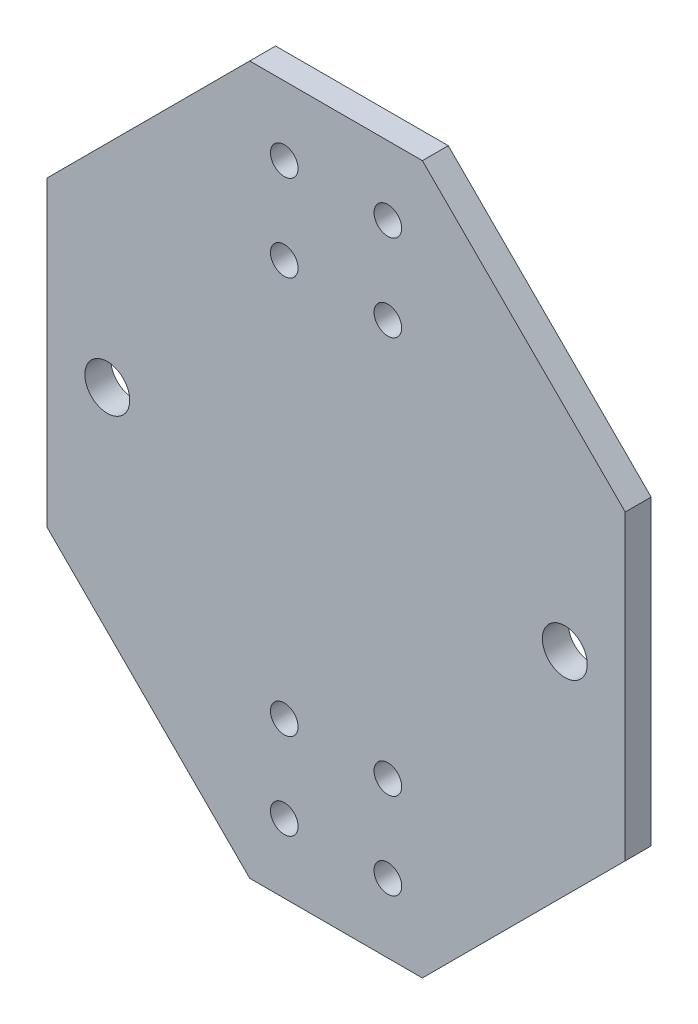
ISO-10303-21;
HEADER;
FILE_DESCRIPTION(('STEP AP214'),'2;1');
FILE_NAME('part.step','',(''),(''),'','','');
FILE_SCHEMA(('AUTOMOTIVE_DESIGN { 1 0 10303 214 1 1 1 1 }'));
ENDSEC;
DATA;
#1=APPLICATION_CONTEXT('core data for automotive mechanical design processes');
#2=APPLICATION_PROTOCOL_DEFINITION('international standard','automotive_design',2000,#1);
#3=PRODUCT_CONTEXT('',#1,'mechanical');
#4=PRODUCT('Part','Part','',(#3));
#5=PRODUCT_RELATED_PRODUCT_CATEGORY('part','',(#4));
#6=PRODUCT_DEFINITION_FORMATION('','',#4);
#7=PRODUCT_DEFINITION_CONTEXT('part definition',#1,'design');
#8=PRODUCT_DEFINITION('design','',#6,#7);
#9=PRODUCT_DEFINITION_SHAPE('','',#8);
#10=(LENGTH_UNIT() NAMED_UNIT(*) SI_UNIT(.MILLI.,.METRE.));
#11=(NAMED_UNIT(*) PLANE_ANGLE_UNIT() SI_UNIT($,.RADIAN.));
#12=(NAMED_UNIT(*) SI_UNIT($,.STERADIAN.) SOLID_ANGLE_UNIT());
#13=UNCERTAINTY_MEASURE_WITH_UNIT(LENGTH_MEASURE(1.E-05),#10,'distance_accuracy_value','');
#14=(GEOMETRIC_REPRESENTATION_CONTEXT(3) GLOBAL_UNCERTAINTY_ASSIGNED_CONTEXT((#13)) GLOBAL_UNIT_ASSIGNED_CONTEXT((#10,
#11,#12)) REPRESENTATION_CONTEXT('',''));
#15=CARTESIAN_POINT('',(0.,0.,0.));
#16=DIRECTION('',(0.,0.,1.));
#17=DIRECTION('',(1.,0.,0.));
#18=AXIS2_PLACEMENT_3D('',#15,#16,#17);
#19=CARTESIAN_POINT('',(0.,0.,3.));
#20=DIRECTION('',(0.,0.,-1.));
#21=DIRECTION('',(-1.,0.,0.));
#22=AXIS2_PLACEMENT_3D('',#19,#20,#21);
#23=PLANE('',#22);
#24=DIRECTION('',(-0.707106781186547,-0.707106781186549,0.));
#25=VECTOR('',#24,1.);
#26=CARTESIAN_POINT('',(-93.5005686119825,-317.094950634666,3.));
#27=LINE('',#26,#25);
#28=CARTESIAN_POINT('',(-70.0005686119825,-293.594950634666,3.));
#29=VERTEX_POINT('',#28);
#30=CARTESIAN_POINT('',(-93.5005686119825,-317.094950634666,3.));
#31=VERTEX_POINT('',#30);
#32=EDGE_CURVE('E147',#29,#31,#27,.T.);
#33=ORIENTED_EDGE('',*,*,#32,.T.);
#34=DIRECTION('',(0.,-1.,0.));
#35=VECTOR('',#34,1.);
#36=CARTESIAN_POINT('',(-93.5005686119825,-352.094950634666,3.));
#37=LINE('',#36,#35);
#38=CARTESIAN_POINT('',(-93.5005686119825,-352.094950634666,3.));
#39=VERTEX_POINT('',#38);
#40=EDGE_CURVE('E95',#31,#39,#37,.T.);
#41=ORIENTED_EDGE('',*,*,#40,.T.);
#42=DIRECTION('',(0.707106781186544,-0.707106781186551,0.));
#43=VECTOR('',#42,1.);
#44=CARTESIAN_POINT('',(-70.0005686119825,-375.594950634666,3.));
#45=LINE('',#44,#43);
#46=CARTESIAN_POINT('',(-70.0005686119825,-375.594950634666,3.));
#47=VERTEX_POINT('',#46);
#48=EDGE_CURVE('E162',#39,#47,#45,.T.);
#49=ORIENTED_EDGE('',*,*,#48,.T.);
#50=DIRECTION('',(1.,0.,0.));
#51=VECTOR('',#50,1.);
#52=CARTESIAN_POINT('',(-50.0005686119826,-375.594950634666,3.));
#53=LINE('',#52,#51);
#54=CARTESIAN_POINT('',(-50.0005686119826,-375.594950634666,3.));
#55=VERTEX_POINT('',#54);
#56=EDGE_CURVE('E175',#47,#55,#53,.T.);
#57=ORIENTED_EDGE('',*,*,#56,.T.);
#58=DIRECTION('',(0.707106781186544,0.707106781186551,0.));
#59=VECTOR('',#58,1.);
#60=CARTESIAN_POINT('',(-26.5005686119826,-352.094950634666,3.));
#61=LINE('',#60,#59);
#62=CARTESIAN_POINT('',(-26.5005686119826,-352.094950634666,3.));
#63=VERTEX_POINT('',#62);
#64=EDGE_CURVE('E114',#55,#63,#61,.T.);
#65=ORIENTED_EDGE('',*,*,#64,.T.);
#66=DIRECTION('',(0.,1.,0.));
#67=VECTOR('',#66,1.);
#68=CARTESIAN_POINT('',(-26.5005686119826,-317.094950634666,3.));
#69=LINE('',#68,#67);
#70=CARTESIAN_POINT('',(-26.5005686119826,-317.094950634666,3.));
#71=VERTEX_POINT('',#70);
#72=EDGE_CURVE('E108',#63,#71,#69,.T.);
#73=ORIENTED_EDGE('',*,*,#72,.T.);
#74=DIRECTION('',(-0.707106781186544,0.707106781186551,0.));
#75=VECTOR('',#74,1.);
#76=CARTESIAN_POINT('',(-50.0005686119826,-293.594950634666,3.));
#77=LINE('',#76,#75);
#78=CARTESIAN_POINT('',(-50.0005686119826,-293.594950634666,3.));
#79=VERTEX_POINT('',#78);
#80=EDGE_CURVE('E112',#71,#79,#77,.T.);
#81=ORIENTED_EDGE('',*,*,#80,.T.);
#82=DIRECTION('',(-1.,0.,0.));
#83=VECTOR('',#82,1.);
#84=CARTESIAN_POINT('',(-70.0005686119825,-293.594950634666,3.));
#85=LINE('',#84,#83);
#86=EDGE_CURVE('E52',#79,#29,#85,.T.);
#87=ORIENTED_EDGE('',*,*,#86,.T.);
#88=EDGE_LOOP('',(#33,#41,#49,#57,#65,#73,#81,#87));
#89=FACE_BOUND('',#88,.T.);
#90=CARTESIAN_POINT('',(-86.5005686119826,-334.594950634666,3.));
#91=DIRECTION('',(0.,0.,1.));
#92=DIRECTION('',(1.,0.,0.));
#93=AXIS2_PLACEMENT_3D('',#90,#91,#92);
#94=CIRCLE('',#93,2.6);
#95=CARTESIAN_POINT('',(-83.9005686119826,-334.594950634666,3.));
#96=VERTEX_POINT('',#95);
#97=EDGE_CURVE('E136',#96,#96,#94,.T.);
#98=ORIENTED_EDGE('',*,*,#97,.F.);
#99=EDGE_LOOP('',(#98));
#100=FACE_BOUND('',#99,.T.);
#101=CARTESIAN_POINT('',(-33.5005686119826,-334.594950634666,3.));
#102=DIRECTION('',(0.,0.,1.));
#103=DIRECTION('',(1.,0.,0.));
#104=AXIS2_PLACEMENT_3D('',#101,#102,#103);
#105=CIRCLE('',#104,2.6);
#106=CARTESIAN_POINT('',(-30.9005686119826,-334.594950634666,3.));
#107=VERTEX_POINT('',#106);
#108=EDGE_CURVE('E184',#107,#107,#105,.T.);
#109=ORIENTED_EDGE('',*,*,#108,.F.);
#110=EDGE_LOOP('',(#109));
#111=FACE_BOUND('',#110,.T.);
#112=CARTESIAN_POINT('',(-66.0005686119825,-301.594950634666,3.));
#113=DIRECTION('',(0.,0.,1.));
#114=DIRECTION('',(1.,0.,0.));
#115=AXIS2_PLACEMENT_3D('',#112,#113,#114);
#116=CIRCLE('',#115,1.6);
#117=CARTESIAN_POINT('',(-64.4005686119825,-301.594950634666,3.));
#118=VERTEX_POINT('',#117);
#119=EDGE_CURVE('E190',#118,#118,#116,.T.);
#120=ORIENTED_EDGE('',*,*,#119,.F.);
#121=EDGE_LOOP('',(#120));
#122=FACE_BOUND('',#121,.T.);
#123=CARTESIAN_POINT('',(-54.0005686119826,-301.594950634666,3.));
#124=DIRECTION('',(0.,0.,1.));
#125=DIRECTION('',(1.,0.,0.));
#126=AXIS2_PLACEMENT_3D('',#123,#124,#125);
#127=CIRCLE('',#126,1.6);
#128=CARTESIAN_POINT('',(-52.4005686119826,-301.594950634666,3.));
#129=VERTEX_POINT('',#128);
#130=EDGE_CURVE('E196',#129,#129,#127,.T.);
#131=ORIENTED_EDGE('',*,*,#130,.F.);
#132=EDGE_LOOP('',(#131));
#133=FACE_BOUND('',#132,.T.);
#134=CARTESIAN_POINT('',(-66.0005686119825,-367.594950634666,3.));
#135=DIRECTION('',(0.,0.,1.));
#136=DIRECTION('',(1.,0.,0.));
#137=AXIS2_PLACEMENT_3D('',#134,#135,#136);
#138=CIRCLE('',#137,1.6);
#139=CARTESIAN_POINT('',(-64.4005686119825,-367.594950634666,3.));
#140=VERTEX_POINT('',#139);
#141=EDGE_CURVE('E202',#140,#140,#138,.T.);
#142=ORIENTED_EDGE('',*,*,#141,.F.);
#143=EDGE_LOOP('',(#142));
#144=FACE_BOUND('',#143,.T.);
#145=CARTESIAN_POINT('',(-54.0005686119826,-367.594950634666,3.));
#146=DIRECTION('',(0.,0.,1.));
#147=DIRECTION('',(1.,0.,0.));
#148=AXIS2_PLACEMENT_3D('',#145,#146,#147);
#149=CIRCLE('',#148,1.6);
#150=CARTESIAN_POINT('',(-52.4005686119826,-367.594950634666,3.));
#151=VERTEX_POINT('',#150);
#152=EDGE_CURVE('E208',#151,#151,#149,.T.);
#153=ORIENTED_EDGE('',*,*,#152,.F.);
#154=EDGE_LOOP('',(#153));
#155=FACE_BOUND('',#154,.T.);
#156=CARTESIAN_POINT('',(-66.0005686119825,-311.594950634666,3.));
#157=DIRECTION('',(0.,0.,1.));
#158=DIRECTION('',(1.,0.,0.));
#159=AXIS2_PLACEMENT_3D('',#156,#157,#158);
#160=CIRCLE('',#159,1.6);
#161=CARTESIAN_POINT('',(-64.4005686119825,-311.594950634666,3.));
#162=VERTEX_POINT('',#161);
#163=EDGE_CURVE('E214',#162,#162,#160,.T.);
#164=ORIENTED_EDGE('',*,*,#163,.F.);
#165=EDGE_LOOP('',(#164));
#166=FACE_BOUND('',#165,.T.);
#167=CARTESIAN_POINT('',(-54.0005686119826,-311.594950634666,3.));
#168=DIRECTION('',(0.,0.,1.));
#169=DIRECTION('',(1.,0.,0.));
#170=AXIS2_PLACEMENT_3D('',#167,#168,#169);
#171=CIRCLE('',#170,1.6);
#172=CARTESIAN_POINT('',(-52.4005686119826,-311.594950634666,3.));
#173=VERTEX_POINT('',#172);
#174=EDGE_CURVE('E220',#173,#173,#171,.T.);
#175=ORIENTED_EDGE('',*,*,#174,.F.);
#176=EDGE_LOOP('',(#175));
#177=FACE_BOUND('',#176,.T.);
#178=CARTESIAN_POINT('',(-66.0005686119825,-357.594950634666,3.));
#179=DIRECTION('',(0.,0.,1.));
#180=DIRECTION('',(1.,0.,0.));
#181=AXIS2_PLACEMENT_3D('',#178,#179,#180);
#182=CIRCLE('',#181,1.6);
#183=CARTESIAN_POINT('',(-64.4005686119825,-357.594950634666,3.));
#184=VERTEX_POINT('',#183);
#185=EDGE_CURVE('E226',#184,#184,#182,.T.);
#186=ORIENTED_EDGE('',*,*,#185,.F.);
#187=EDGE_LOOP('',(#186));
#188=FACE_BOUND('',#187,.T.);
#189=CARTESIAN_POINT('',(-54.0005686119826,-357.594950634666,3.));
#190=DIRECTION('',(0.,0.,1.));
#191=DIRECTION('',(1.,0.,0.));
#192=AXIS2_PLACEMENT_3D('',#189,#190,#191);
#193=CIRCLE('',#192,1.6);
#194=CARTESIAN_POINT('',(-52.4005686119826,-357.594950634666,3.));
#195=VERTEX_POINT('',#194);
#196=EDGE_CURVE('E232',#195,#195,#193,.T.);
#197=ORIENTED_EDGE('',*,*,#196,.F.);
#198=EDGE_LOOP('',(#197));
#199=FACE_BOUND('',#198,.T.);
#200=ADVANCED_FACE('F35',(#89,#100,#111,#122,#133,#144,#155,#166,#177,#188,#199),#23,.F.);
#201=CARTESIAN_POINT('',(0.,0.,0.));
#202=DIRECTION('',(0.,0.,-1.));
#203=DIRECTION('',(-1.,0.,0.));
#204=AXIS2_PLACEMENT_3D('',#201,#202,#203);
#205=PLANE('',#204);
#206=CARTESIAN_POINT('',(-66.0005686119825,-357.594950634666,0.));
#207=DIRECTION('',(0.,0.,1.));
#208=DIRECTION('',(1.,0.,0.));
#209=AXIS2_PLACEMENT_3D('',#206,#207,#208);
#210=CIRCLE('',#209,1.6);
#211=CARTESIAN_POINT('',(-64.4005686119825,-357.594950634666,0.));
#212=VERTEX_POINT('',#211);
#213=EDGE_CURVE('E229',#212,#212,#210,.T.);
#214=ORIENTED_EDGE('',*,*,#213,.T.);
#215=EDGE_LOOP('',(#214));
#216=FACE_BOUND('',#215,.T.);
#217=CARTESIAN_POINT('',(-66.0005686119825,-311.594950634666,0.));
#218=DIRECTION('',(0.,0.,1.));
#219=DIRECTION('',(1.,0.,0.));
#220=AXIS2_PLACEMENT_3D('',#217,#218,#219);
#221=CIRCLE('',#220,1.6);
#222=CARTESIAN_POINT('',(-64.4005686119825,-311.594950634666,0.));
#223=VERTEX_POINT('',#222);
#224=EDGE_CURVE('E217',#223,#223,#221,.T.);
#225=ORIENTED_EDGE('',*,*,#224,.T.);
#226=EDGE_LOOP('',(#225));
#227=FACE_BOUND('',#226,.T.);
#228=CARTESIAN_POINT('',(-66.0005686119825,-367.594950634666,0.));
#229=DIRECTION('',(0.,0.,1.));
#230=DIRECTION('',(1.,0.,0.));
#231=AXIS2_PLACEMENT_3D('',#228,#229,#230);
#232=CIRCLE('',#231,1.6);
#233=CARTESIAN_POINT('',(-64.4005686119825,-367.594950634666,0.));
#234=VERTEX_POINT('',#233);
#235=EDGE_CURVE('E205',#234,#234,#232,.T.);
#236=ORIENTED_EDGE('',*,*,#235,.T.);
#237=EDGE_LOOP('',(#236));
#238=FACE_BOUND('',#237,.T.);
#239=CARTESIAN_POINT('',(-66.0005686119825,-301.594950634666,0.));
#240=DIRECTION('',(0.,0.,1.));
#241=DIRECTION('',(1.,0.,0.));
#242=AXIS2_PLACEMENT_3D('',#239,#240,#241);
#243=CIRCLE('',#242,1.6);
#244=CARTESIAN_POINT('',(-64.4005686119825,-301.594950634666,0.));
#245=VERTEX_POINT('',#244);
#246=EDGE_CURVE('E193',#245,#245,#243,.T.);
#247=ORIENTED_EDGE('',*,*,#246,.T.);
#248=EDGE_LOOP('',(#247));
#249=FACE_BOUND('',#248,.T.);
#250=CARTESIAN_POINT('',(-86.5005686119826,-334.594950634666,0.));
#251=DIRECTION('',(0.,0.,1.));
#252=DIRECTION('',(1.,0.,0.));
#253=AXIS2_PLACEMENT_3D('',#250,#251,#252);
#254=CIRCLE('',#253,2.6);
#255=CARTESIAN_POINT('',(-83.9005686119826,-334.594950634666,0.));
#256=VERTEX_POINT('',#255);
#257=EDGE_CURVE('E181',#256,#256,#254,.T.);
#258=ORIENTED_EDGE('',*,*,#257,.T.);
#259=EDGE_LOOP('',(#258));
#260=FACE_BOUND('',#259,.T.);
#261=DIRECTION('',(-0.707106781186547,-0.707106781186549,0.));
#262=VECTOR('',#261,1.);
#263=CARTESIAN_POINT('',(-93.5005686119825,-317.094950634666,0.));
#264=LINE('',#263,#262);
#265=CARTESIAN_POINT('',(-70.0005686119825,-293.594950634666,0.));
#266=VERTEX_POINT('',#265);
#267=CARTESIAN_POINT('',(-93.5005686119825,-317.094950634666,0.));
#268=VERTEX_POINT('',#267);
#269=EDGE_CURVE('E132',#266,#268,#264,.T.);
#270=ORIENTED_EDGE('',*,*,#269,.F.);
#271=DIRECTION('',(-1.,0.,0.));
#272=VECTOR('',#271,1.);
#273=CARTESIAN_POINT('',(-70.0005686119825,-293.594950634666,0.));
#274=LINE('',#273,#272);
#275=CARTESIAN_POINT('',(-50.0005686119826,-293.594950634666,0.));
#276=VERTEX_POINT('',#275);
#277=EDGE_CURVE('E87',#276,#266,#274,.T.);
#278=ORIENTED_EDGE('',*,*,#277,.F.);
#279=DIRECTION('',(-0.707106781186544,0.707106781186551,0.));
#280=VECTOR('',#279,1.);
#281=CARTESIAN_POINT('',(-50.0005686119826,-293.594950634666,0.));
#282=LINE('',#281,#280);
#283=CARTESIAN_POINT('',(-26.5005686119826,-317.094950634666,0.));
#284=VERTEX_POINT('',#283);
#285=EDGE_CURVE('E81',#284,#276,#282,.T.);
#286=ORIENTED_EDGE('',*,*,#285,.F.);
#287=DIRECTION('',(0.,1.,0.));
#288=VECTOR('',#287,1.);
#289=CARTESIAN_POINT('',(-26.5005686119826,-317.094950634666,0.));
#290=LINE('',#289,#288);
#291=CARTESIAN_POINT('',(-26.5005686119826,-352.094950634666,0.));
#292=VERTEX_POINT('',#291);
#293=EDGE_CURVE('E122',#292,#284,#290,.T.);
#294=ORIENTED_EDGE('',*,*,#293,.F.);
#295=DIRECTION('',(0.707106781186544,0.707106781186551,0.));
#296=VECTOR('',#295,1.);
#297=CARTESIAN_POINT('',(-26.5005686119826,-352.094950634666,0.));
#298=LINE('',#297,#296);
#299=CARTESIAN_POINT('',(-50.0005686119826,-375.594950634666,0.));
#300=VERTEX_POINT('',#299);
#301=EDGE_CURVE('E142',#300,#292,#298,.T.);
#302=ORIENTED_EDGE('',*,*,#301,.F.);
#303=DIRECTION('',(1.,0.,0.));
#304=VECTOR('',#303,1.);
#305=CARTESIAN_POINT('',(-50.0005686119826,-375.594950634666,0.));
#306=LINE('',#305,#304);
#307=CARTESIAN_POINT('',(-70.0005686119825,-375.594950634666,0.));
#308=VERTEX_POINT('',#307);
#309=EDGE_CURVE('E140',#308,#300,#306,.T.);
#310=ORIENTED_EDGE('',*,*,#309,.F.);
#311=DIRECTION('',(0.707106781186544,-0.707106781186551,0.));
#312=VECTOR('',#311,1.);
#313=CARTESIAN_POINT('',(-70.0005686119825,-375.594950634666,0.));
#314=LINE('',#313,#312);
#315=CARTESIAN_POINT('',(-93.5005686119825,-352.094950634666,0.));
#316=VERTEX_POINT('',#315);
#317=EDGE_CURVE('E138',#316,#308,#314,.T.);
#318=ORIENTED_EDGE('',*,*,#317,.F.);
#319=DIRECTION('',(0.,-1.,0.));
#320=VECTOR('',#319,1.);
#321=CARTESIAN_POINT('',(-93.5005686119825,-352.094950634666,0.));
#322=LINE('',#321,#320);
#323=EDGE_CURVE('E135',#268,#316,#322,.T.);
#324=ORIENTED_EDGE('',*,*,#323,.F.);
#325=EDGE_LOOP('',(#270,#278,#286,#294,#302,#310,#318,#324));
#326=FACE_BOUND('',#325,.T.);
#327=CARTESIAN_POINT('',(-33.5005686119826,-334.594950634666,0.));
#328=DIRECTION('',(0.,0.,1.));
#329=DIRECTION('',(1.,0.,0.));
#330=AXIS2_PLACEMENT_3D('',#327,#328,#329);
#331=CIRCLE('',#330,2.6);
#332=CARTESIAN_POINT('',(-30.9005686119826,-334.594950634666,0.));
#333=VERTEX_POINT('',#332);
#334=EDGE_CURVE('E187',#333,#333,#331,.T.);
#335=ORIENTED_EDGE('',*,*,#334,.T.);
#336=EDGE_LOOP('',(#335));
#337=FACE_BOUND('',#336,.T.);
#338=CARTESIAN_POINT('',(-54.0005686119826,-301.594950634666,0.));
#339=DIRECTION('',(0.,0.,1.));
#340=DIRECTION('',(1.,0.,0.));
#341=AXIS2_PLACEMENT_3D('',#338,#339,#340);
#342=CIRCLE('',#341,1.6);
#343=CARTESIAN_POINT('',(-52.4005686119826,-301.594950634666,0.));
#344=VERTEX_POINT('',#343);
#345=EDGE_CURVE('E199',#344,#344,#342,.T.);
#346=ORIENTED_EDGE('',*,*,#345,.T.);
#347=EDGE_LOOP('',(#346));
#348=FACE_BOUND('',#347,.T.);
#349=CARTESIAN_POINT('',(-54.0005686119826,-367.594950634666,0.));
#350=DIRECTION('',(0.,0.,1.));
#351=DIRECTION('',(1.,0.,0.));
#352=AXIS2_PLACEMENT_3D('',#349,#350,#351);
#353=CIRCLE('',#352,1.6);
#354=CARTESIAN_POINT('',(-52.4005686119826,-367.594950634666,0.));
#355=VERTEX_POINT('',#354);
#356=EDGE_CURVE('E211',#355,#355,#353,.T.);
#357=ORIENTED_EDGE('',*,*,#356,.T.);
#358=EDGE_LOOP('',(#357));
#359=FACE_BOUND('',#358,.T.);
#360=CARTESIAN_POINT('',(-54.0005686119826,-311.594950634666,0.));
#361=DIRECTION('',(0.,0.,1.));
#362=DIRECTION('',(1.,0.,0.));
#363=AXIS2_PLACEMENT_3D('',#360,#361,#362);
#364=CIRCLE('',#363,1.6);
#365=CARTESIAN_POINT('',(-52.4005686119826,-311.594950634666,0.));
#366=VERTEX_POINT('',#365);
#367=EDGE_CURVE('E223',#366,#366,#364,.T.);
#368=ORIENTED_EDGE('',*,*,#367,.T.);
#369=EDGE_LOOP('',(#368));
#370=FACE_BOUND('',#369,.T.);
#371=CARTESIAN_POINT('',(-54.0005686119826,-357.594950634666,0.));
#372=DIRECTION('',(0.,0.,1.));
#373=DIRECTION('',(1.,0.,0.));
#374=AXIS2_PLACEMENT_3D('',#371,#372,#373);
#375=CIRCLE('',#374,1.6);
#376=CARTESIAN_POINT('',(-52.4005686119826,-357.594950634666,0.));
#377=VERTEX_POINT('',#376);
#378=EDGE_CURVE('E235',#377,#377,#375,.T.);
#379=ORIENTED_EDGE('',*,*,#378,.T.);
#380=EDGE_LOOP('',(#379));
#381=FACE_BOUND('',#380,.T.);
#382=ADVANCED_FACE('F166',(#216,#227,#238,#249,#260,#326,#337,#348,#359,#370,#381),#205,.T.);
#383=CARTESIAN_POINT('',(-93.5005686119825,-317.094950634666,3.));
#384=DIRECTION('',(0.707106781186548,-0.707106781186546,0.));
#385=DIRECTION('',(0.707106781186547,0.707106781186549,0.));
#386=AXIS2_PLACEMENT_3D('',#383,#384,#385);
#387=PLANE('',#386);
#388=ORIENTED_EDGE('',*,*,#269,.T.);
#389=DIRECTION('',(0.,0.,-1.));
#390=VECTOR('',#389,1.);
#391=CARTESIAN_POINT('',(-93.5005686119825,-317.094950634666,3.));
#392=LINE('',#391,#390);
#393=EDGE_CURVE('E11',#31,#268,#392,.T.);
#394=ORIENTED_EDGE('',*,*,#393,.F.);
#395=ORIENTED_EDGE('',*,*,#32,.F.);
#396=DIRECTION('',(0.,0.,-1.));
#397=VECTOR('',#396,1.);
#398=CARTESIAN_POINT('',(-70.0005686119825,-293.594950634666,3.));
#399=LINE('',#398,#397);
#400=EDGE_CURVE('E128',#29,#266,#399,.T.);
#401=ORIENTED_EDGE('',*,*,#400,.T.);
#402=EDGE_LOOP('',(#388,#394,#395,#401));
#403=FACE_BOUND('',#402,.T.);
#404=ADVANCED_FACE('F37',(#403),#387,.F.);
#405=CARTESIAN_POINT('',(-93.5005686119825,-352.094950634666,3.));
#406=DIRECTION('',(1.,0.,0.));
#407=DIRECTION('',(0.,0.,-1.));
#408=AXIS2_PLACEMENT_3D('',#405,#406,#407);
#409=PLANE('',#408);
#410=ORIENTED_EDGE('',*,*,#323,.T.);
#411=DIRECTION('',(0.,0.,-1.));
#412=VECTOR('',#411,1.);
#413=CARTESIAN_POINT('',(-93.5005686119825,-352.094950634666,3.));
#414=LINE('',#413,#412);
#415=EDGE_CURVE('E44',#39,#316,#414,.T.);
#416=ORIENTED_EDGE('',*,*,#415,.F.);
#417=ORIENTED_EDGE('',*,*,#40,.F.);
#418=ORIENTED_EDGE('',*,*,#393,.T.);
#419=EDGE_LOOP('',(#410,#416,#417,#418));
#420=FACE_BOUND('',#419,.T.);
#421=ADVANCED_FACE('F267',(#420),#409,.F.);
#422=CARTESIAN_POINT('',(-70.0005686119825,-375.594950634666,3.));
#423=DIRECTION('',(0.707106781186551,0.707106781186544,0.));
#424=DIRECTION('',(-0.707106781186544,0.707106781186551,0.));
#425=AXIS2_PLACEMENT_3D('',#422,#423,#424);
#426=PLANE('',#425);
#427=ORIENTED_EDGE('',*,*,#317,.T.);
#428=DIRECTION('',(0.,0.,-1.));
#429=VECTOR('',#428,1.);
#430=CARTESIAN_POINT('',(-70.0005686119825,-375.594950634666,3.));
#431=LINE('',#430,#429);
#432=EDGE_CURVE('E154',#47,#308,#431,.T.);
#433=ORIENTED_EDGE('',*,*,#432,.F.);
#434=ORIENTED_EDGE('',*,*,#48,.F.);
#435=ORIENTED_EDGE('',*,*,#415,.T.);
#436=EDGE_LOOP('',(#427,#433,#434,#435));
#437=FACE_BOUND('',#436,.T.);
#438=ADVANCED_FACE('F160',(#437),#426,.F.);
#439=CARTESIAN_POINT('',(-50.0005686119826,-375.594950634666,3.));
#440=DIRECTION('',(0.,1.,0.));
#441=DIRECTION('',(0.,0.,1.));
#442=AXIS2_PLACEMENT_3D('',#439,#440,#441);
#443=PLANE('',#442);
#444=ORIENTED_EDGE('',*,*,#309,.T.);
#445=DIRECTION('',(0.,0.,-1.));
#446=VECTOR('',#445,1.);
#447=CARTESIAN_POINT('',(-50.0005686119826,-375.594950634666,3.));
#448=LINE('',#447,#446);
#449=EDGE_CURVE('E151',#55,#300,#448,.T.);
#450=ORIENTED_EDGE('',*,*,#449,.F.);
#451=ORIENTED_EDGE('',*,*,#56,.F.);
#452=ORIENTED_EDGE('',*,*,#432,.T.);
#453=EDGE_LOOP('',(#444,#450,#451,#452));
#454=FACE_BOUND('',#453,.T.);
#455=ADVANCED_FACE('F171',(#454),#443,.F.);
#456=CARTESIAN_POINT('',(-26.5005686119826,-352.094950634666,3.));
#457=DIRECTION('',(-0.707106781186551,0.707106781186544,0.));
#458=DIRECTION('',(-0.707106781186544,-0.707106781186551,0.));
#459=AXIS2_PLACEMENT_3D('',#456,#457,#458);
#460=PLANE('',#459);
#461=ORIENTED_EDGE('',*,*,#301,.T.);
#462=DIRECTION('',(0.,0.,-1.));
#463=VECTOR('',#462,1.);
#464=CARTESIAN_POINT('',(-26.5005686119826,-352.094950634666,3.));
#465=LINE('',#464,#463);
#466=EDGE_CURVE('E123',#63,#292,#465,.T.);
#467=ORIENTED_EDGE('',*,*,#466,.F.);
#468=ORIENTED_EDGE('',*,*,#64,.F.);
#469=ORIENTED_EDGE('',*,*,#449,.T.);
#470=EDGE_LOOP('',(#461,#467,#468,#469));
#471=FACE_BOUND('',#470,.T.);
#472=ADVANCED_FACE('F174',(#471),#460,.F.);
#473=CARTESIAN_POINT('',(-26.5005686119826,-317.094950634666,3.));
#474=DIRECTION('',(-1.,0.,0.));
#475=DIRECTION('',(0.,-1.,0.));
#476=AXIS2_PLACEMENT_3D('',#473,#474,#475);
#477=PLANE('',#476);
#478=ORIENTED_EDGE('',*,*,#293,.T.);
#479=DIRECTION('',(0.,0.,-1.));
#480=VECTOR('',#479,1.);
#481=CARTESIAN_POINT('',(-26.5005686119826,-317.094950634666,3.));
#482=LINE('',#481,#480);
#483=EDGE_CURVE('E119',#71,#284,#482,.T.);
#484=ORIENTED_EDGE('',*,*,#483,.F.);
#485=ORIENTED_EDGE('',*,*,#72,.F.);
#486=ORIENTED_EDGE('',*,*,#466,.T.);
#487=EDGE_LOOP('',(#478,#484,#485,#486));
#488=FACE_BOUND('',#487,.T.);
#489=ADVANCED_FACE('F120',(#488),#477,.F.);
#490=CARTESIAN_POINT('',(-50.0005686119826,-293.594950634666,3.));
#491=DIRECTION('',(-0.707106781186551,-0.707106781186544,0.));
#492=DIRECTION('',(0.707106781186544,-0.707106781186551,0.));
#493=AXIS2_PLACEMENT_3D('',#490,#491,#492);
#494=PLANE('',#493);
#495=ORIENTED_EDGE('',*,*,#285,.T.);
#496=DIRECTION('',(0.,0.,-1.));
#497=VECTOR('',#496,1.);
#498=CARTESIAN_POINT('',(-50.0005686119826,-293.594950634666,3.));
#499=LINE('',#498,#497);
#500=EDGE_CURVE('E124',#79,#276,#499,.T.);
#501=ORIENTED_EDGE('',*,*,#500,.F.);
#502=ORIENTED_EDGE('',*,*,#80,.F.);
#503=ORIENTED_EDGE('',*,*,#483,.T.);
#504=EDGE_LOOP('',(#495,#501,#502,#503));
#505=FACE_BOUND('',#504,.T.);
#506=ADVANCED_FACE('F126',(#505),#494,.F.);
#507=CARTESIAN_POINT('',(-70.0005686119825,-293.594950634666,3.));
#508=DIRECTION('',(0.,-1.,0.));
#509=DIRECTION('',(0.,0.,-1.));
#510=AXIS2_PLACEMENT_3D('',#507,#508,#509);
#511=PLANE('',#510);
#512=ORIENTED_EDGE('',*,*,#277,.T.);
#513=ORIENTED_EDGE('',*,*,#400,.F.);
#514=ORIENTED_EDGE('',*,*,#86,.F.);
#515=ORIENTED_EDGE('',*,*,#500,.T.);
#516=EDGE_LOOP('',(#512,#513,#514,#515));
#517=FACE_BOUND('',#516,.T.);
#518=ADVANCED_FACE('F255',(#517),#511,.F.);
#519=CARTESIAN_POINT('',(-86.5005686119826,-334.594950634666,3.));
#520=DIRECTION('',(0.,0.,-1.));
#521=DIRECTION('',(-1.,0.,0.));
#522=AXIS2_PLACEMENT_3D('',#519,#520,#521);
#523=CYLINDRICAL_SURFACE('',#522,2.6);
#524=ORIENTED_EDGE('',*,*,#97,.T.);
#525=EDGE_LOOP('',(#524));
#526=FACE_BOUND('',#525,.T.);
#527=ORIENTED_EDGE('',*,*,#257,.F.);
#528=EDGE_LOOP('',(#527));
#529=FACE_BOUND('',#528,.T.);
#530=ADVANCED_FACE('F252',(#526,#529),#523,.F.);
#531=CARTESIAN_POINT('',(-33.5005686119826,-334.594950634666,3.));
#532=DIRECTION('',(0.,0.,-1.));
#533=DIRECTION('',(-1.,0.,0.));
#534=AXIS2_PLACEMENT_3D('',#531,#532,#533);
#535=CYLINDRICAL_SURFACE('',#534,2.6);
#536=ORIENTED_EDGE('',*,*,#108,.T.);
#537=EDGE_LOOP('',(#536));
#538=FACE_BOUND('',#537,.T.);
#539=ORIENTED_EDGE('',*,*,#334,.F.);
#540=EDGE_LOOP('',(#539));
#541=FACE_BOUND('',#540,.T.);
#542=ADVANCED_FACE('F331',(#538,#541),#535,.F.);
#543=CARTESIAN_POINT('',(-66.0005686119825,-301.594950634666,3.));
#544=DIRECTION('',(0.,0.,-1.));
#545=DIRECTION('',(-1.,0.,0.));
#546=AXIS2_PLACEMENT_3D('',#543,#544,#545);
#547=CYLINDRICAL_SURFACE('',#546,1.6);
#548=ORIENTED_EDGE('',*,*,#119,.T.);
#549=EDGE_LOOP('',(#548));
#550=FACE_BOUND('',#549,.T.);
#551=ORIENTED_EDGE('',*,*,#246,.F.);
#552=EDGE_LOOP('',(#551));
#553=FACE_BOUND('',#552,.T.);
#554=ADVANCED_FACE('F339',(#550,#553),#547,.F.);
#555=CARTESIAN_POINT('',(-54.0005686119826,-301.594950634666,3.));
#556=DIRECTION('',(0.,0.,-1.));
#557=DIRECTION('',(-1.,0.,0.));
#558=AXIS2_PLACEMENT_3D('',#555,#556,#557);
#559=CYLINDRICAL_SURFACE('',#558,1.6);
#560=ORIENTED_EDGE('',*,*,#130,.T.);
#561=EDGE_LOOP('',(#560));
#562=FACE_BOUND('',#561,.T.);
#563=ORIENTED_EDGE('',*,*,#345,.F.);
#564=EDGE_LOOP('',(#563));
#565=FACE_BOUND('',#564,.T.);
#566=ADVANCED_FACE('F347',(#562,#565),#559,.F.);
#567=CARTESIAN_POINT('',(-66.0005686119825,-367.594950634666,3.));
#568=DIRECTION('',(0.,0.,-1.));
#569=DIRECTION('',(-1.,0.,0.));
#570=AXIS2_PLACEMENT_3D('',#567,#568,#569);
#571=CYLINDRICAL_SURFACE('',#570,1.6);
#572=ORIENTED_EDGE('',*,*,#141,.T.);
#573=EDGE_LOOP('',(#572));
#574=FACE_BOUND('',#573,.T.);
#575=ORIENTED_EDGE('',*,*,#235,.F.);
#576=EDGE_LOOP('',(#575));
#577=FACE_BOUND('',#576,.T.);
#578=ADVANCED_FACE('F356',(#574,#577),#571,.F.);
#579=CARTESIAN_POINT('',(-54.0005686119826,-367.594950634666,3.));
#580=DIRECTION('',(0.,0.,-1.));
#581=DIRECTION('',(-1.,0.,0.));
#582=AXIS2_PLACEMENT_3D('',#579,#580,#581);
#583=CYLINDRICAL_SURFACE('',#582,1.6);
#584=ORIENTED_EDGE('',*,*,#152,.T.);
#585=EDGE_LOOP('',(#584));
#586=FACE_BOUND('',#585,.T.);
#587=ORIENTED_EDGE('',*,*,#356,.F.);
#588=EDGE_LOOP('',(#587));
#589=FACE_BOUND('',#588,.T.);
#590=ADVANCED_FACE('F365',(#586,#589),#583,.F.);
#591=CARTESIAN_POINT('',(-66.0005686119825,-311.594950634666,3.));
#592=DIRECTION('',(0.,0.,-1.));
#593=DIRECTION('',(-1.,0.,0.));
#594=AXIS2_PLACEMENT_3D('',#591,#592,#593);
#595=CYLINDRICAL_SURFACE('',#594,1.6);
#596=ORIENTED_EDGE('',*,*,#163,.T.);
#597=EDGE_LOOP('',(#596));
#598=FACE_BOUND('',#597,.T.);
#599=ORIENTED_EDGE('',*,*,#224,.F.);
#600=EDGE_LOOP('',(#599));
#601=FACE_BOUND('',#600,.T.);
#602=ADVANCED_FACE('F374',(#598,#601),#595,.F.);
#603=CARTESIAN_POINT('',(-54.0005686119826,-311.594950634666,3.));
#604=DIRECTION('',(0.,0.,-1.));
#605=DIRECTION('',(-1.,0.,0.));
#606=AXIS2_PLACEMENT_3D('',#603,#604,#605);
#607=CYLINDRICAL_SURFACE('',#606,1.6);
#608=ORIENTED_EDGE('',*,*,#174,.T.);
#609=EDGE_LOOP('',(#608));
#610=FACE_BOUND('',#609,.T.);
#611=ORIENTED_EDGE('',*,*,#367,.F.);
#612=EDGE_LOOP('',(#611));
#613=FACE_BOUND('',#612,.T.);
#614=ADVANCED_FACE('F383',(#610,#613),#607,.F.);
#615=CARTESIAN_POINT('',(-66.0005686119825,-357.594950634666,3.));
#616=DIRECTION('',(0.,0.,-1.));
#617=DIRECTION('',(-1.,0.,0.));
#618=AXIS2_PLACEMENT_3D('',#615,#616,#617);
#619=CYLINDRICAL_SURFACE('',#618,1.6);
#620=ORIENTED_EDGE('',*,*,#185,.T.);
#621=EDGE_LOOP('',(#620));
#622=FACE_BOUND('',#621,.T.);
#623=ORIENTED_EDGE('',*,*,#213,.F.);
#624=EDGE_LOOP('',(#623));
#625=FACE_BOUND('',#624,.T.);
#626=ADVANCED_FACE('F392',(#622,#625),#619,.F.);
#627=CARTESIAN_POINT('',(-54.0005686119826,-357.594950634666,3.));
#628=DIRECTION('',(0.,0.,-1.));
#629=DIRECTION('',(-1.,0.,0.));
#630=AXIS2_PLACEMENT_3D('',#627,#628,#629);
#631=CYLINDRICAL_SURFACE('',#630,1.6);
#632=ORIENTED_EDGE('',*,*,#196,.T.);
#633=EDGE_LOOP('',(#632));
#634=FACE_BOUND('',#633,.T.);
#635=ORIENTED_EDGE('',*,*,#378,.F.);
#636=EDGE_LOOP('',(#635));
#637=FACE_BOUND('',#636,.T.);
#638=ADVANCED_FACE('F241',(#634,#637),#631,.F.);
#639=CLOSED_SHELL('',(#200,#382,#404,#421,#438,#455,#472,#489,#506,#518,#530,#542,#554,#566,
#578,#590,#602,#614,#626,#638));
#640=MANIFOLD_SOLID_BREP('B2',#639);
#641=ADVANCED_BREP_SHAPE_REPRESENTATION('',(#18,#640),#14);
#642=SHAPE_DEFINITION_REPRESENTATION(#9,#641);
ENDSEC;
END-ISO-10303-21;
